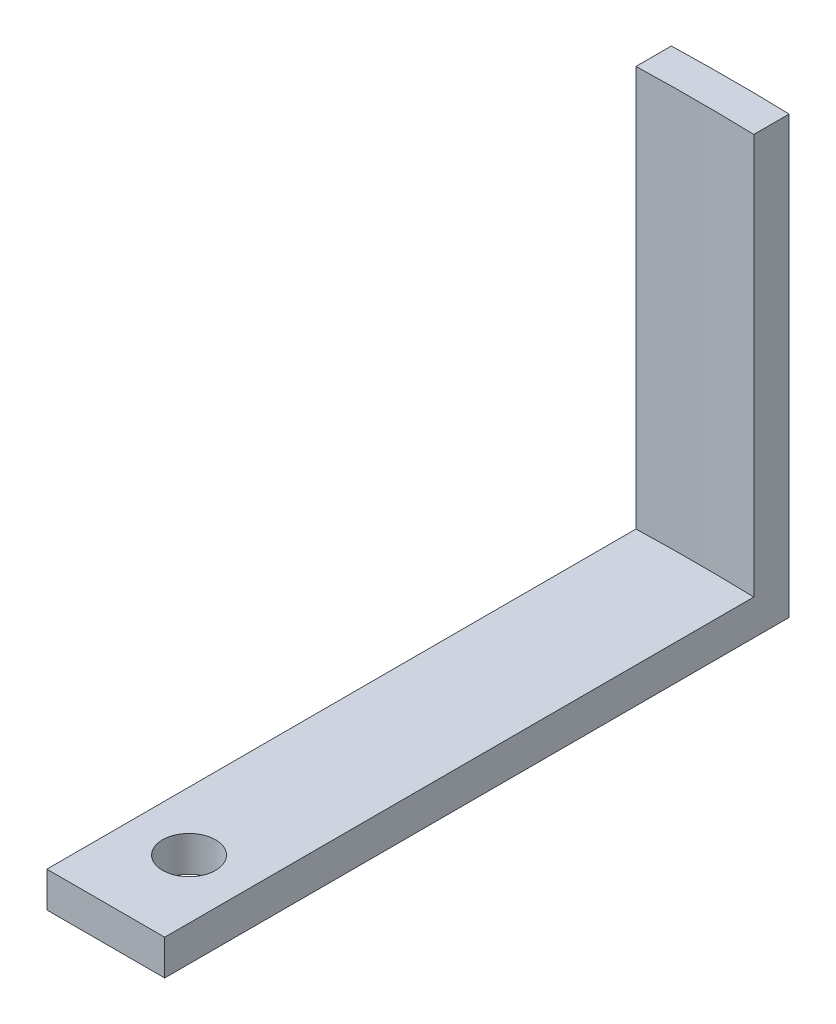
ISO-10303-21;
HEADER;
FILE_DESCRIPTION(('STEP AP214'),'2;1');
FILE_NAME('part.step','',(''),(''),'','','');
FILE_SCHEMA(('AUTOMOTIVE_DESIGN { 1 0 10303 214 1 1 1 1 }'));
ENDSEC;
DATA;
#1=APPLICATION_CONTEXT('core data for automotive mechanical design processes');
#2=APPLICATION_PROTOCOL_DEFINITION('international standard','automotive_design',2000,#1);
#3=PRODUCT_CONTEXT('',#1,'mechanical');
#4=PRODUCT('Part','Part','',(#3));
#5=PRODUCT_RELATED_PRODUCT_CATEGORY('part','',(#4));
#6=PRODUCT_DEFINITION_FORMATION('','',#4);
#7=PRODUCT_DEFINITION_CONTEXT('part definition',#1,'design');
#8=PRODUCT_DEFINITION('design','',#6,#7);
#9=PRODUCT_DEFINITION_SHAPE('','',#8);
#10=(LENGTH_UNIT() NAMED_UNIT(*) SI_UNIT(.MILLI.,.METRE.));
#11=(NAMED_UNIT(*) PLANE_ANGLE_UNIT() SI_UNIT($,.RADIAN.));
#12=(NAMED_UNIT(*) SI_UNIT($,.STERADIAN.) SOLID_ANGLE_UNIT());
#13=UNCERTAINTY_MEASURE_WITH_UNIT(LENGTH_MEASURE(1.E-05),#10,'distance_accuracy_value','');
#14=(GEOMETRIC_REPRESENTATION_CONTEXT(3) GLOBAL_UNCERTAINTY_ASSIGNED_CONTEXT((#13)) GLOBAL_UNIT_ASSIGNED_CONTEXT((#10,
#11,#12)) REPRESENTATION_CONTEXT('',''));
#15=CARTESIAN_POINT('',(0.,0.,0.));
#16=DIRECTION('',(0.,0.,1.));
#17=DIRECTION('',(1.,0.,0.));
#18=AXIS2_PLACEMENT_3D('',#15,#16,#17);
#19=CARTESIAN_POINT('',(-4.99999999999984,3.,-177.929761422872));
#20=DIRECTION('',(1.,0.,0.));
#21=DIRECTION('',(0.,0.,-1.));
#22=AXIS2_PLACEMENT_3D('',#19,#20,#21);
#23=PLANE('',#22);
#24=DIRECTION('',(0.,0.,1.));
#25=VECTOR('',#24,1.);
#26=CARTESIAN_POINT('',(-4.99999999999984,0.,-177.929761422872));
#27=LINE('',#26,#25);
#28=CARTESIAN_POINT('',(-4.99999999999939,0.,-180.929761422872));
#29=VERTEX_POINT('',#28);
#30=CARTESIAN_POINT('',(-5.,0.,-127.929761422872));
#31=VERTEX_POINT('',#30);
#32=EDGE_CURVE('E63',#29,#31,#27,.T.);
#33=ORIENTED_EDGE('',*,*,#32,.T.);
#34=DIRECTION('',(0.,-1.,0.));
#35=VECTOR('',#34,1.);
#36=CARTESIAN_POINT('',(-5.,3.,-127.929761422872));
#37=LINE('',#36,#35);
#38=CARTESIAN_POINT('',(-5.,3.,-127.929761422872));
#39=VERTEX_POINT('',#38);
#40=EDGE_CURVE('E11',#39,#31,#37,.T.);
#41=ORIENTED_EDGE('',*,*,#40,.F.);
#42=DIRECTION('',(0.,0.,1.));
#43=VECTOR('',#42,1.);
#44=CARTESIAN_POINT('',(-4.99999999999984,3.,-177.929761422872));
#45=LINE('',#44,#43);
#46=CARTESIAN_POINT('',(-4.99999999999984,3.,-177.929761422872));
#47=VERTEX_POINT('',#46);
#48=EDGE_CURVE('E87',#47,#39,#45,.T.);
#49=ORIENTED_EDGE('',*,*,#48,.F.);
#50=DIRECTION('',(0.,-1.,0.));
#51=VECTOR('',#50,1.);
#52=CARTESIAN_POINT('',(-4.99999999999984,37.,-177.929761422872));
#53=LINE('',#52,#51);
#54=CARTESIAN_POINT('',(-4.99999999999984,37.,-177.929761422872));
#55=VERTEX_POINT('',#54);
#56=EDGE_CURVE('E136',#55,#47,#53,.T.);
#57=ORIENTED_EDGE('',*,*,#56,.F.);
#58=DIRECTION('',(1.41379963292108E-13,0.,-1.));
#59=VECTOR('',#58,1.);
#60=CARTESIAN_POINT('',(-4.99999999999942,37.,-180.929761422872));
#61=LINE('',#60,#59);
#62=CARTESIAN_POINT('',(-4.99999999999939,37.,-180.929761422872));
#63=VERTEX_POINT('',#62);
#64=EDGE_CURVE('E122',#55,#63,#61,.T.);
#65=ORIENTED_EDGE('',*,*,#64,.T.);
#66=DIRECTION('',(0.,-1.,0.));
#67=VECTOR('',#66,1.);
#68=CARTESIAN_POINT('',(-4.99999999999939,37.,-180.929761422872));
#69=LINE('',#68,#67);
#70=EDGE_CURVE('E134',#63,#29,#69,.T.);
#71=ORIENTED_EDGE('',*,*,#70,.T.);
#72=EDGE_LOOP('',(#33,#41,#49,#57,#65,#71));
#73=FACE_BOUND('',#72,.T.);
#74=ADVANCED_FACE('F35',(#73),#23,.F.);
#75=CARTESIAN_POINT('',(-5.,3.,-127.929761422872));
#76=DIRECTION('',(0.,0.,-1.));
#77=DIRECTION('',(-1.,0.,0.));
#78=AXIS2_PLACEMENT_3D('',#75,#76,#77);
#79=PLANE('',#78);
#80=DIRECTION('',(1.,0.,0.));
#81=VECTOR('',#80,1.);
#82=CARTESIAN_POINT('',(-5.,0.,-127.929761422872));
#83=LINE('',#82,#81);
#84=CARTESIAN_POINT('',(5.,0.,-127.929761422872));
#85=VERTEX_POINT('',#84);
#86=EDGE_CURVE('E105',#31,#85,#83,.T.);
#87=ORIENTED_EDGE('',*,*,#86,.T.);
#88=DIRECTION('',(0.,-1.,0.));
#89=VECTOR('',#88,1.);
#90=CARTESIAN_POINT('',(5.,3.,-127.929761422872));
#91=LINE('',#90,#89);
#92=CARTESIAN_POINT('',(5.,3.,-127.929761422872));
#93=VERTEX_POINT('',#92);
#94=EDGE_CURVE('E43',#93,#85,#91,.T.);
#95=ORIENTED_EDGE('',*,*,#94,.F.);
#96=DIRECTION('',(1.,0.,0.));
#97=VECTOR('',#96,1.);
#98=CARTESIAN_POINT('',(-5.,3.,-127.929761422872));
#99=LINE('',#98,#97);
#100=EDGE_CURVE('E90',#39,#93,#99,.T.);
#101=ORIENTED_EDGE('',*,*,#100,.F.);
#102=ORIENTED_EDGE('',*,*,#40,.T.);
#103=EDGE_LOOP('',(#87,#95,#101,#102));
#104=FACE_BOUND('',#103,.T.);
#105=ADVANCED_FACE('F98',(#104),#79,.F.);
#106=CARTESIAN_POINT('',(5.,3.,-127.929761422872));
#107=DIRECTION('',(-1.,0.,0.));
#108=DIRECTION('',(0.,0.,1.));
#109=AXIS2_PLACEMENT_3D('',#106,#107,#108);
#110=PLANE('',#109);
#111=DIRECTION('',(0.,0.,-1.));
#112=VECTOR('',#111,1.);
#113=CARTESIAN_POINT('',(5.,0.,-127.929761422872));
#114=LINE('',#113,#112);
#115=CARTESIAN_POINT('',(5.00000000000017,0.,-180.929761422872));
#116=VERTEX_POINT('',#115);
#117=EDGE_CURVE('E107',#85,#116,#114,.T.);
#118=ORIENTED_EDGE('',*,*,#117,.T.);
#119=DIRECTION('',(0.,-1.,0.));
#120=VECTOR('',#119,1.);
#121=CARTESIAN_POINT('',(5.00000000000017,37.,-180.929761422872));
#122=LINE('',#121,#120);
#123=CARTESIAN_POINT('',(5.00000000000017,37.,-180.929761422872));
#124=VERTEX_POINT('',#123);
#125=EDGE_CURVE('E132',#124,#116,#122,.T.);
#126=ORIENTED_EDGE('',*,*,#125,.F.);
#127=DIRECTION('',(0.,0.,1.));
#128=VECTOR('',#127,1.);
#129=CARTESIAN_POINT('',(5.00000000000017,37.,-177.929761422872));
#130=LINE('',#129,#128);
#131=CARTESIAN_POINT('',(5.00000000000017,37.,-177.929761422872));
#132=VERTEX_POINT('',#131);
#133=EDGE_CURVE('E129',#124,#132,#130,.T.);
#134=ORIENTED_EDGE('',*,*,#133,.T.);
#135=DIRECTION('',(0.,-1.,0.));
#136=VECTOR('',#135,1.);
#137=CARTESIAN_POINT('',(5.00000000000017,37.,-177.929761422872));
#138=LINE('',#137,#136);
#139=CARTESIAN_POINT('',(5.00000000000017,3.,-177.929761422872));
#140=VERTEX_POINT('',#139);
#141=EDGE_CURVE('E72',#132,#140,#138,.T.);
#142=ORIENTED_EDGE('',*,*,#141,.T.);
#143=DIRECTION('',(0.,0.,-1.));
#144=VECTOR('',#143,1.);
#145=CARTESIAN_POINT('',(5.,3.,-127.929761422872));
#146=LINE('',#145,#144);
#147=EDGE_CURVE('E51',#93,#140,#146,.T.);
#148=ORIENTED_EDGE('',*,*,#147,.F.);
#149=ORIENTED_EDGE('',*,*,#94,.T.);
#150=EDGE_LOOP('',(#118,#126,#134,#142,#148,#149));
#151=FACE_BOUND('',#150,.T.);
#152=ADVANCED_FACE('F110',(#151),#110,.F.);
#153=CARTESIAN_POINT('',(0.,3.,0.));
#154=DIRECTION('',(0.,-1.,0.));
#155=DIRECTION('',(0.,0.,-1.));
#156=AXIS2_PLACEMENT_3D('',#153,#154,#155);
#157=PLANE('',#156);
#158=CARTESIAN_POINT('',(0.,3.,-135.));
#159=DIRECTION('',(0.,-1.,0.));
#160=DIRECTION('',(0.,0.,-1.));
#161=AXIS2_PLACEMENT_3D('',#158,#159,#160);
#162=CIRCLE('',#161,2.25);
#163=CARTESIAN_POINT('',(0.,3.,-137.25));
#164=VERTEX_POINT('',#163);
#165=EDGE_CURVE('E120',#164,#164,#162,.F.);
#166=ORIENTED_EDGE('',*,*,#165,.F.);
#167=EDGE_LOOP('',(#166));
#168=FACE_BOUND('',#167,.T.);
#169=CARTESIAN_POINT('',(0.,3.,0.));
#170=DIRECTION('',(0.,1.,0.));
#171=DIRECTION('',(0.,0.,-1.));
#172=AXIS2_PLACEMENT_3D('',#169,#170,#171);
#173=CIRCLE('',#172,178.);
#174=EDGE_CURVE('E92',#140,#47,#173,.T.);
#175=ORIENTED_EDGE('',*,*,#174,.T.);
#176=ORIENTED_EDGE('',*,*,#48,.T.);
#177=ORIENTED_EDGE('',*,*,#100,.T.);
#178=ORIENTED_EDGE('',*,*,#147,.T.);
#179=EDGE_LOOP('',(#175,#176,#177,#178));
#180=FACE_BOUND('',#179,.T.);
#181=ADVANCED_FACE('F88',(#168,#180),#157,.F.);
#182=CARTESIAN_POINT('',(0.,0.,0.));
#183=DIRECTION('',(0.,-1.,0.));
#184=DIRECTION('',(0.,0.,-1.));
#185=AXIS2_PLACEMENT_3D('',#182,#183,#184);
#186=PLANE('',#185);
#187=CARTESIAN_POINT('',(0.,0.,-135.));
#188=DIRECTION('',(0.,-1.,0.));
#189=DIRECTION('',(0.,0.,-1.));
#190=AXIS2_PLACEMENT_3D('',#187,#188,#189);
#191=CIRCLE('',#190,2.25);
#192=CARTESIAN_POINT('',(0.,0.,-137.25));
#193=VERTEX_POINT('',#192);
#194=EDGE_CURVE('E125',#193,#193,#191,.T.);
#195=ORIENTED_EDGE('',*,*,#194,.F.);
#196=EDGE_LOOP('',(#195));
#197=FACE_BOUND('',#196,.T.);
#198=ORIENTED_EDGE('',*,*,#32,.F.);
#199=CARTESIAN_POINT('',(0.,0.,0.));
#200=DIRECTION('',(0.,-1.,0.));
#201=DIRECTION('',(0.,0.,1.));
#202=AXIS2_PLACEMENT_3D('',#199,#200,#201);
#203=CIRCLE('',#202,180.998835820945);
#204=EDGE_CURVE('E116',#29,#116,#203,.T.);
#205=ORIENTED_EDGE('',*,*,#204,.T.);
#206=ORIENTED_EDGE('',*,*,#117,.F.);
#207=ORIENTED_EDGE('',*,*,#86,.F.);
#208=EDGE_LOOP('',(#198,#205,#206,#207));
#209=FACE_BOUND('',#208,.T.);
#210=ADVANCED_FACE('F114',(#197,#209),#186,.T.);
#211=CARTESIAN_POINT('',(0.,37.,0.));
#212=DIRECTION('',(0.,-1.,0.));
#213=DIRECTION('',(0.,0.,-1.));
#214=AXIS2_PLACEMENT_3D('',#211,#212,#213);
#215=CYLINDRICAL_SURFACE('',#214,178.);
#216=ORIENTED_EDGE('',*,*,#174,.F.);
#217=ORIENTED_EDGE('',*,*,#141,.F.);
#218=CARTESIAN_POINT('',(0.,37.,0.));
#219=DIRECTION('',(0.,1.,0.));
#220=DIRECTION('',(0.,0.,1.));
#221=AXIS2_PLACEMENT_3D('',#218,#219,#220);
#222=CIRCLE('',#221,178.);
#223=EDGE_CURVE('E119',#132,#55,#222,.T.);
#224=ORIENTED_EDGE('',*,*,#223,.T.);
#225=ORIENTED_EDGE('',*,*,#56,.T.);
#226=EDGE_LOOP('',(#216,#217,#224,#225));
#227=FACE_BOUND('',#226,.T.);
#228=ADVANCED_FACE('F152',(#227),#215,.F.);
#229=CARTESIAN_POINT('',(0.,37.,0.));
#230=DIRECTION('',(0.,-1.,0.));
#231=DIRECTION('',(0.,0.,-1.));
#232=AXIS2_PLACEMENT_3D('',#229,#230,#231);
#233=CYLINDRICAL_SURFACE('',#232,180.998835820945);
#234=ORIENTED_EDGE('',*,*,#204,.F.);
#235=ORIENTED_EDGE('',*,*,#70,.F.);
#236=CARTESIAN_POINT('',(0.,37.,0.));
#237=DIRECTION('',(0.,-1.,0.));
#238=DIRECTION('',(0.,0.,1.));
#239=AXIS2_PLACEMENT_3D('',#236,#237,#238);
#240=CIRCLE('',#239,180.998835820945);
#241=EDGE_CURVE('E138',#63,#124,#240,.T.);
#242=ORIENTED_EDGE('',*,*,#241,.T.);
#243=ORIENTED_EDGE('',*,*,#125,.T.);
#244=EDGE_LOOP('',(#234,#235,#242,#243));
#245=FACE_BOUND('',#244,.T.);
#246=ADVANCED_FACE('F158',(#245),#233,.T.);
#247=CARTESIAN_POINT('',(0.,37.,0.));
#248=DIRECTION('',(0.,1.,0.));
#249=DIRECTION('',(0.,0.,1.));
#250=AXIS2_PLACEMENT_3D('',#247,#248,#249);
#251=PLANE('',#250);
#252=ORIENTED_EDGE('',*,*,#223,.F.);
#253=ORIENTED_EDGE('',*,*,#133,.F.);
#254=ORIENTED_EDGE('',*,*,#241,.F.);
#255=ORIENTED_EDGE('',*,*,#64,.F.);
#256=EDGE_LOOP('',(#252,#253,#254,#255));
#257=FACE_BOUND('',#256,.T.);
#258=ADVANCED_FACE('F184',(#257),#251,.T.);
#259=CARTESIAN_POINT('',(0.,37.001,-135.));
#260=DIRECTION('',(0.,-1.,0.));
#261=DIRECTION('',(0.,0.,-1.));
#262=AXIS2_PLACEMENT_3D('',#259,#260,#261);
#263=CYLINDRICAL_SURFACE('',#262,2.25);
#264=ORIENTED_EDGE('',*,*,#194,.T.);
#265=EDGE_LOOP('',(#264));
#266=FACE_BOUND('',#265,.T.);
#267=ORIENTED_EDGE('',*,*,#165,.T.);
#268=EDGE_LOOP('',(#267));
#269=FACE_BOUND('',#268,.T.);
#270=ADVANCED_FACE('F148',(#266,#269),#263,.F.);
#271=CLOSED_SHELL('',(#74,#105,#152,#181,#210,#228,#246,#258,#270));
#272=MANIFOLD_SOLID_BREP('B2',#271);
#273=ADVANCED_BREP_SHAPE_REPRESENTATION('',(#18,#272),#14);
#274=SHAPE_DEFINITION_REPRESENTATION(#9,#273);
ENDSEC;
END-ISO-10303-21;
